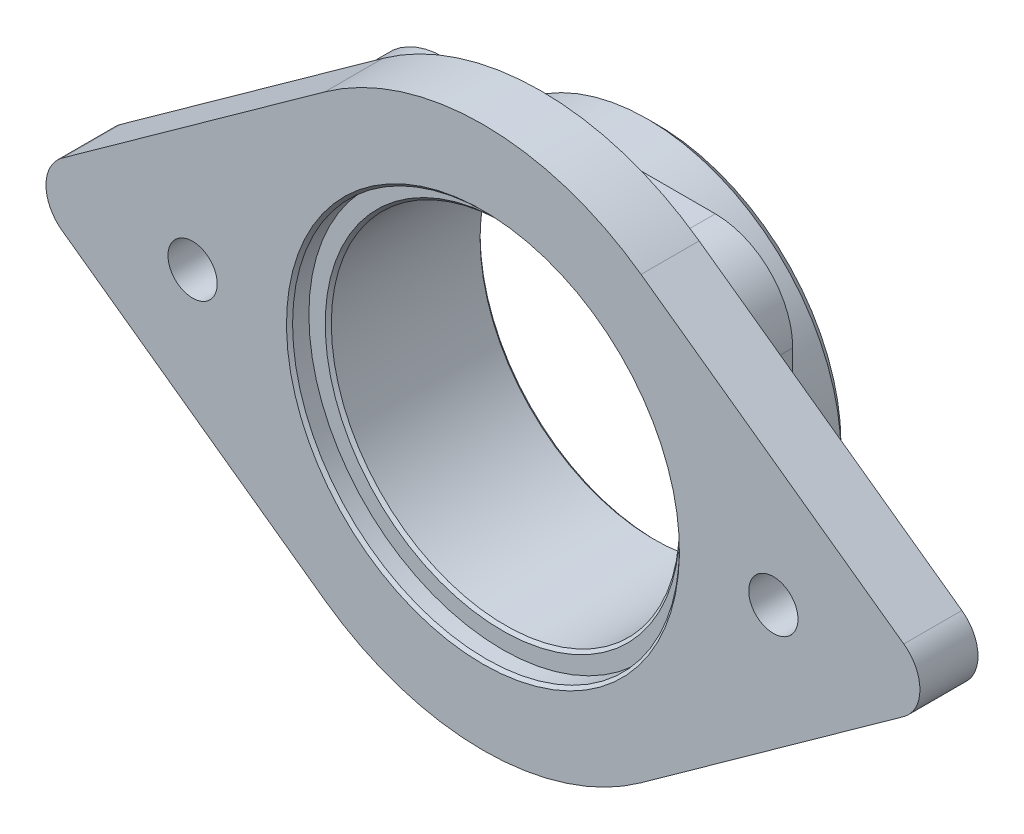
ISO-10303-21;
HEADER;
FILE_DESCRIPTION(('STEP AP214'),'2;1');
FILE_NAME('part.step','',(''),(''),'','','');
FILE_SCHEMA(('AUTOMOTIVE_DESIGN { 1 0 10303 214 1 1 1 1 }'));
ENDSEC;
DATA;
#1=APPLICATION_CONTEXT('core data for automotive mechanical design processes');
#2=APPLICATION_PROTOCOL_DEFINITION('international standard','automotive_design',2000,#1);
#3=PRODUCT_CONTEXT('',#1,'mechanical');
#4=PRODUCT('Part','Part','',(#3));
#5=PRODUCT_RELATED_PRODUCT_CATEGORY('part','',(#4));
#6=PRODUCT_DEFINITION_FORMATION('','',#4);
#7=PRODUCT_DEFINITION_CONTEXT('part definition',#1,'design');
#8=PRODUCT_DEFINITION('design','',#6,#7);
#9=PRODUCT_DEFINITION_SHAPE('','',#8);
#10=(LENGTH_UNIT() NAMED_UNIT(*) SI_UNIT(.MILLI.,.METRE.));
#11=(NAMED_UNIT(*) PLANE_ANGLE_UNIT() SI_UNIT($,.RADIAN.));
#12=(NAMED_UNIT(*) SI_UNIT($,.STERADIAN.) SOLID_ANGLE_UNIT());
#13=UNCERTAINTY_MEASURE_WITH_UNIT(LENGTH_MEASURE(1.E-05),#10,'distance_accuracy_value','');
#14=(GEOMETRIC_REPRESENTATION_CONTEXT(3) GLOBAL_UNCERTAINTY_ASSIGNED_CONTEXT((#13)) GLOBAL_UNIT_ASSIGNED_CONTEXT((#10,
#11,#12)) REPRESENTATION_CONTEXT('',''));
#15=CARTESIAN_POINT('',(0.,0.,0.));
#16=DIRECTION('',(0.,0.,1.));
#17=DIRECTION('',(1.,0.,0.));
#18=AXIS2_PLACEMENT_3D('',#15,#16,#17);
#19=CARTESIAN_POINT('',(0.,0.,-11.90625));
#20=DIRECTION('',(0.,0.,-1.));
#21=DIRECTION('',(-1.,0.,0.));
#22=AXIS2_PLACEMENT_3D('',#19,#20,#21);
#23=PLANE('',#22);
#24=CARTESIAN_POINT('',(0.,0.,-11.90625));
#25=DIRECTION('',(0.,0.,-1.));
#26=DIRECTION('',(-1.,0.,0.));
#27=AXIS2_PLACEMENT_3D('',#24,#25,#26);
#28=CIRCLE('',#27,14.5248);
#29=CARTESIAN_POINT('',(-14.5248,0.,-11.90625));
#30=VERTEX_POINT('',#29);
#31=EDGE_CURVE('E19',#30,#30,#28,.F.);
#32=ORIENTED_EDGE('',*,*,#31,.T.);
#33=EDGE_LOOP('',(#32));
#34=FACE_BOUND('',#33,.T.);
#35=CARTESIAN_POINT('',(0.,0.,-11.90625));
#36=DIRECTION('',(0.,0.,1.));
#37=DIRECTION('',(1.,0.,0.));
#38=AXIS2_PLACEMENT_3D('',#35,#36,#37);
#39=CIRCLE('',#38,15.06855);
#40=CARTESIAN_POINT('',(15.06855,0.,-11.90625));
#41=VERTEX_POINT('',#40);
#42=EDGE_CURVE('E167',#41,#41,#39,.T.);
#43=ORIENTED_EDGE('',*,*,#42,.F.);
#44=EDGE_LOOP('',(#43));
#45=FACE_BOUND('',#44,.T.);
#46=ADVANCED_FACE('F16',(#34,#45),#23,.T.);
#47=CARTESIAN_POINT('',(0.,0.,-11.90625));
#48=DIRECTION('',(0.,0.,-1.));
#49=DIRECTION('',(-1.,0.,0.));
#50=AXIS2_PLACEMENT_3D('',#47,#48,#49);
#51=CONICAL_SURFACE('',#50,14.5248,0.785398163397452);
#52=CARTESIAN_POINT('',(0.,0.,-11.65625));
#53=DIRECTION('',(0.,0.,-1.));
#54=DIRECTION('',(-1.,0.,0.));
#55=AXIS2_PLACEMENT_3D('',#52,#53,#54);
#56=CIRCLE('',#55,14.2748);
#57=CARTESIAN_POINT('',(-14.2748,0.,-11.65625));
#58=VERTEX_POINT('',#57);
#59=EDGE_CURVE('E165',#58,#58,#56,.F.);
#60=ORIENTED_EDGE('',*,*,#59,.T.);
#61=EDGE_LOOP('',(#60));
#62=FACE_BOUND('',#61,.T.);
#63=ORIENTED_EDGE('',*,*,#31,.F.);
#64=EDGE_LOOP('',(#63));
#65=FACE_BOUND('',#64,.T.);
#66=ADVANCED_FACE('F249',(#62,#65),#51,.F.);
#67=CARTESIAN_POINT('',(0.,0.,-11.1125));
#68=DIRECTION('',(0.,0.,1.));
#69=DIRECTION('',(1.,0.,0.));
#70=AXIS2_PLACEMENT_3D('',#67,#68,#69);
#71=CONICAL_SURFACE('',#70,15.8623,0.785398163397446);
#72=ORIENTED_EDGE('',*,*,#42,.T.);
#73=EDGE_LOOP('',(#72));
#74=FACE_BOUND('',#73,.T.);
#75=CARTESIAN_POINT('',(0.,0.,-11.1125));
#76=DIRECTION('',(0.,0.,1.));
#77=DIRECTION('',(1.,0.,0.));
#78=AXIS2_PLACEMENT_3D('',#75,#76,#77);
#79=CIRCLE('',#78,15.8623);
#80=CARTESIAN_POINT('',(15.8623,0.,-11.1125));
#81=VERTEX_POINT('',#80);
#82=EDGE_CURVE('E162',#81,#81,#79,.T.);
#83=ORIENTED_EDGE('',*,*,#82,.F.);
#84=EDGE_LOOP('',(#83));
#85=FACE_BOUND('',#84,.T.);
#86=ADVANCED_FACE('F251',(#74,#85),#71,.T.);
#87=CARTESIAN_POINT('',(0.,0.,2.38125));
#88=DIRECTION('',(0.,0.,-1.));
#89=DIRECTION('',(-1.,0.,0.));
#90=AXIS2_PLACEMENT_3D('',#87,#88,#89);
#91=CYLINDRICAL_SURFACE('',#90,14.2748);
#92=CARTESIAN_POINT('',(0.,0.,0.543749999999951));
#93=DIRECTION('',(0.,0.,1.));
#94=DIRECTION('',(1.,0.,0.));
#95=AXIS2_PLACEMENT_3D('',#92,#93,#94);
#96=CIRCLE('',#95,14.2748);
#97=CARTESIAN_POINT('',(14.2748,0.,0.54374999999995));
#98=VERTEX_POINT('',#97);
#99=EDGE_CURVE('E158',#98,#98,#96,.T.);
#100=ORIENTED_EDGE('',*,*,#99,.T.);
#101=EDGE_LOOP('',(#100));
#102=FACE_BOUND('',#101,.T.);
#103=ORIENTED_EDGE('',*,*,#59,.F.);
#104=EDGE_LOOP('',(#103));
#105=FACE_BOUND('',#104,.T.);
#106=ADVANCED_FACE('F258',(#102,#105),#91,.F.);
#107=CARTESIAN_POINT('',(0.,0.,-11.90625));
#108=DIRECTION('',(0.,0.,1.));
#109=DIRECTION('',(1.,0.,0.));
#110=AXIS2_PLACEMENT_3D('',#107,#108,#109);
#111=CYLINDRICAL_SURFACE('',#110,15.8623);
#112=ORIENTED_EDGE('',*,*,#82,.T.);
#113=EDGE_LOOP('',(#112));
#114=FACE_BOUND('',#113,.T.);
#115=CARTESIAN_POINT('',(0.,0.,-5.55625));
#116=DIRECTION('',(0.,0.,1.));
#117=DIRECTION('',(1.,0.,0.));
#118=AXIS2_PLACEMENT_3D('',#115,#116,#117);
#119=CIRCLE('',#118,15.8623);
#120=CARTESIAN_POINT('',(15.8623,0.,-5.55625));
#121=VERTEX_POINT('',#120);
#122=EDGE_CURVE('E161',#121,#121,#119,.F.);
#123=ORIENTED_EDGE('',*,*,#122,.T.);
#124=EDGE_LOOP('',(#123));
#125=FACE_BOUND('',#124,.T.);
#126=ADVANCED_FACE('F358',(#114,#125),#111,.T.);
#127=CARTESIAN_POINT('',(0.,0.,0.793750000000002));
#128=DIRECTION('',(0.,0.,1.));
#129=DIRECTION('',(1.,0.,0.));
#130=AXIS2_PLACEMENT_3D('',#127,#128,#129);
#131=CONICAL_SURFACE('',#130,14.5248,0.785398163397435);
#132=ORIENTED_EDGE('',*,*,#99,.F.);
#133=EDGE_LOOP('',(#132));
#134=FACE_BOUND('',#133,.T.);
#135=CARTESIAN_POINT('',(0.,0.,0.793750000000001));
#136=DIRECTION('',(0.,0.,1.));
#137=DIRECTION('',(1.,0.,0.));
#138=AXIS2_PLACEMENT_3D('',#135,#136,#137);
#139=CIRCLE('',#138,14.5248);
#140=CARTESIAN_POINT('',(14.5248,0.,0.793750000000001));
#141=VERTEX_POINT('',#140);
#142=EDGE_CURVE('E138',#141,#141,#139,.F.);
#143=ORIENTED_EDGE('',*,*,#142,.F.);
#144=EDGE_LOOP('',(#143));
#145=FACE_BOUND('',#144,.T.);
#146=ADVANCED_FACE('F354',(#134,#145),#131,.F.);
#147=CARTESIAN_POINT('',(0.,0.,-5.55625));
#148=DIRECTION('',(0.,0.,1.));
#149=DIRECTION('',(1.,0.,0.));
#150=AXIS2_PLACEMENT_3D('',#147,#148,#149);
#151=PLANE('',#150);
#152=ORIENTED_EDGE('',*,*,#122,.F.);
#153=EDGE_LOOP('',(#152));
#154=FACE_BOUND('',#153,.T.);
#155=CARTESIAN_POINT('',(11.1125,-11.1125,-5.55625));
#156=DIRECTION('',(0.,0.,1.));
#157=DIRECTION('',(1.,0.,0.));
#158=AXIS2_PLACEMENT_3D('',#155,#156,#157);
#159=CIRCLE('',#158,6.35);
#160=CARTESIAN_POINT('',(11.1125,-17.4625,-5.55625));
#161=VERTEX_POINT('',#160);
#162=CARTESIAN_POINT('',(17.4625,-11.1125,-5.55625));
#163=VERTEX_POINT('',#162);
#164=EDGE_CURVE('E151',#161,#163,#159,.T.);
#165=ORIENTED_EDGE('',*,*,#164,.F.);
#166=DIRECTION('',(1.,0.,0.));
#167=VECTOR('',#166,1.);
#168=CARTESIAN_POINT('',(17.4625,-17.4625,-5.55625));
#169=LINE('',#168,#167);
#170=CARTESIAN_POINT('',(-11.1125,-17.4625,-5.55625));
#171=VERTEX_POINT('',#170);
#172=EDGE_CURVE('E156',#161,#171,#169,.F.);
#173=ORIENTED_EDGE('',*,*,#172,.T.);
#174=CARTESIAN_POINT('',(-11.1125,-11.1125,-5.55625));
#175=DIRECTION('',(0.,0.,1.));
#176=DIRECTION('',(1.,0.,0.));
#177=AXIS2_PLACEMENT_3D('',#174,#175,#176);
#178=CIRCLE('',#177,6.35);
#179=CARTESIAN_POINT('',(-17.4625,-11.1125,-5.55625));
#180=VERTEX_POINT('',#179);
#181=EDGE_CURVE('E234',#180,#171,#178,.T.);
#182=ORIENTED_EDGE('',*,*,#181,.F.);
#183=DIRECTION('',(0.,1.,0.));
#184=VECTOR('',#183,1.);
#185=CARTESIAN_POINT('',(-17.4625,-17.4625,-5.55625));
#186=LINE('',#185,#184);
#187=CARTESIAN_POINT('',(-17.4625,11.1125,-5.55625));
#188=VERTEX_POINT('',#187);
#189=EDGE_CURVE('E233',#180,#188,#186,.T.);
#190=ORIENTED_EDGE('',*,*,#189,.T.);
#191=CARTESIAN_POINT('',(-11.1125,11.1125,-5.55625));
#192=DIRECTION('',(0.,0.,1.));
#193=DIRECTION('',(1.,0.,0.));
#194=AXIS2_PLACEMENT_3D('',#191,#192,#193);
#195=CIRCLE('',#194,6.35);
#196=CARTESIAN_POINT('',(-11.1125,17.4625,-5.55625));
#197=VERTEX_POINT('',#196);
#198=EDGE_CURVE('E229',#197,#188,#195,.T.);
#199=ORIENTED_EDGE('',*,*,#198,.F.);
#200=DIRECTION('',(1.,0.,0.));
#201=VECTOR('',#200,1.);
#202=CARTESIAN_POINT('',(17.4625,17.4625,-5.55625));
#203=LINE('',#202,#201);
#204=CARTESIAN_POINT('',(11.1125,17.4625,-5.55625));
#205=VERTEX_POINT('',#204);
#206=EDGE_CURVE('E134',#197,#205,#203,.T.);
#207=ORIENTED_EDGE('',*,*,#206,.T.);
#208=CARTESIAN_POINT('',(11.1125,11.1125,-5.55625));
#209=DIRECTION('',(0.,0.,1.));
#210=DIRECTION('',(1.,0.,0.));
#211=AXIS2_PLACEMENT_3D('',#208,#209,#210);
#212=CIRCLE('',#211,6.35);
#213=CARTESIAN_POINT('',(17.4625,11.1125,-5.55625));
#214=VERTEX_POINT('',#213);
#215=EDGE_CURVE('E127',#214,#205,#212,.T.);
#216=ORIENTED_EDGE('',*,*,#215,.F.);
#217=DIRECTION('',(0.,1.,0.));
#218=VECTOR('',#217,1.);
#219=CARTESIAN_POINT('',(17.4625,-17.4625,-5.55625));
#220=LINE('',#219,#218);
#221=EDGE_CURVE('E131',#214,#163,#220,.F.);
#222=ORIENTED_EDGE('',*,*,#221,.T.);
#223=EDGE_LOOP('',(#165,#173,#182,#190,#199,#207,#216,#222));
#224=FACE_BOUND('',#223,.T.);
#225=ADVANCED_FACE('F129',(#154,#224),#151,.F.);
#226=CARTESIAN_POINT('',(0.,0.,0.79375));
#227=DIRECTION('',(0.,0.,1.));
#228=DIRECTION('',(1.,0.,0.));
#229=AXIS2_PLACEMENT_3D('',#226,#227,#228);
#230=PLANE('',#229);
#231=CARTESIAN_POINT('',(0.,0.,0.79375));
#232=DIRECTION('',(0.,0.,1.));
#233=DIRECTION('',(1.,0.,0.));
#234=AXIS2_PLACEMENT_3D('',#231,#232,#233);
#235=CIRCLE('',#234,15.8623);
#236=CARTESIAN_POINT('',(15.8623,0.,0.79375));
#237=VERTEX_POINT('',#236);
#238=EDGE_CURVE('E226',#237,#237,#235,.T.);
#239=ORIENTED_EDGE('',*,*,#238,.T.);
#240=EDGE_LOOP('',(#239));
#241=FACE_BOUND('',#240,.T.);
#242=ORIENTED_EDGE('',*,*,#142,.T.);
#243=EDGE_LOOP('',(#242));
#244=FACE_BOUND('',#243,.T.);
#245=ADVANCED_FACE('F348',(#241,#244),#230,.T.);
#246=CARTESIAN_POINT('',(11.1125,11.1125,-5.55625));
#247=DIRECTION('',(0.,0.,1.));
#248=DIRECTION('',(1.,0.,0.));
#249=AXIS2_PLACEMENT_3D('',#246,#247,#248);
#250=CYLINDRICAL_SURFACE('',#249,6.35);
#251=CARTESIAN_POINT('',(11.1125,11.1125,-2.38125));
#252=DIRECTION('',(0.,0.,1.));
#253=DIRECTION('',(1.,0.,0.));
#254=AXIS2_PLACEMENT_3D('',#251,#252,#253);
#255=CIRCLE('',#254,6.35);
#256=CARTESIAN_POINT('',(11.1125,17.4625,-2.38125));
#257=VERTEX_POINT('',#256);
#258=CARTESIAN_POINT('',(17.4625,11.1125,-2.38125));
#259=VERTEX_POINT('',#258);
#260=EDGE_CURVE('E143',#257,#259,#255,.F.);
#261=ORIENTED_EDGE('',*,*,#260,.T.);
#262=DIRECTION('',(0.,0.,1.));
#263=VECTOR('',#262,1.);
#264=CARTESIAN_POINT('',(17.4625,11.1125,-5.55625));
#265=LINE('',#264,#263);
#266=EDGE_CURVE('E137',#259,#214,#265,.F.);
#267=ORIENTED_EDGE('',*,*,#266,.T.);
#268=ORIENTED_EDGE('',*,*,#215,.T.);
#269=DIRECTION('',(0.,0.,-1.));
#270=VECTOR('',#269,1.);
#271=CARTESIAN_POINT('',(11.1125,17.4625,-5.55625));
#272=LINE('',#271,#270);
#273=EDGE_CURVE('E607',#205,#257,#272,.F.);
#274=ORIENTED_EDGE('',*,*,#273,.T.);
#275=EDGE_LOOP('',(#261,#267,#268,#274));
#276=FACE_BOUND('',#275,.T.);
#277=ADVANCED_FACE('F141',(#276),#250,.T.);
#278=CARTESIAN_POINT('',(17.4625,-17.4625,-5.55625));
#279=DIRECTION('',(-1.,0.,0.));
#280=DIRECTION('',(0.,0.,1.));
#281=AXIS2_PLACEMENT_3D('',#278,#279,#280);
#282=PLANE('',#281);
#283=DIRECTION('',(0.,0.,1.));
#284=VECTOR('',#283,1.);
#285=CARTESIAN_POINT('',(17.4625,-11.1125,-5.55625));
#286=LINE('',#285,#284);
#287=CARTESIAN_POINT('',(17.4625,-11.1125,-2.38125));
#288=VERTEX_POINT('',#287);
#289=EDGE_CURVE('E149',#163,#288,#286,.T.);
#290=ORIENTED_EDGE('',*,*,#289,.F.);
#291=ORIENTED_EDGE('',*,*,#221,.F.);
#292=ORIENTED_EDGE('',*,*,#266,.F.);
#293=DIRECTION('',(0.,1.,0.));
#294=VECTOR('',#293,1.);
#295=CARTESIAN_POINT('',(17.4625,0.,-2.38125));
#296=LINE('',#295,#294);
#297=EDGE_CURVE('E224',#259,#288,#296,.F.);
#298=ORIENTED_EDGE('',*,*,#297,.T.);
#299=EDGE_LOOP('',(#290,#291,#292,#298));
#300=FACE_BOUND('',#299,.T.);
#301=ADVANCED_FACE('F147',(#300),#282,.F.);
#302=CARTESIAN_POINT('',(11.1125,-11.1125,-5.55625));
#303=DIRECTION('',(0.,0.,1.));
#304=DIRECTION('',(1.,0.,0.));
#305=AXIS2_PLACEMENT_3D('',#302,#303,#304);
#306=CYLINDRICAL_SURFACE('',#305,6.35);
#307=CARTESIAN_POINT('',(11.1125,-11.1125,-2.38125));
#308=DIRECTION('',(0.,0.,1.));
#309=DIRECTION('',(1.,0.,0.));
#310=AXIS2_PLACEMENT_3D('',#307,#308,#309);
#311=CIRCLE('',#310,6.35);
#312=CARTESIAN_POINT('',(11.1125,-17.4625,-2.38125));
#313=VERTEX_POINT('',#312);
#314=EDGE_CURVE('E222',#288,#313,#311,.F.);
#315=ORIENTED_EDGE('',*,*,#314,.T.);
#316=DIRECTION('',(0.,0.,1.));
#317=VECTOR('',#316,1.);
#318=CARTESIAN_POINT('',(11.1125,-17.4625,-5.55625));
#319=LINE('',#318,#317);
#320=EDGE_CURVE('E616',#313,#161,#319,.F.);
#321=ORIENTED_EDGE('',*,*,#320,.T.);
#322=ORIENTED_EDGE('',*,*,#164,.T.);
#323=ORIENTED_EDGE('',*,*,#289,.T.);
#324=EDGE_LOOP('',(#315,#321,#322,#323));
#325=FACE_BOUND('',#324,.T.);
#326=ADVANCED_FACE('F339',(#325),#306,.T.);
#327=CARTESIAN_POINT('',(17.4625,-17.4625,-5.55625));
#328=DIRECTION('',(0.,1.,0.));
#329=DIRECTION('',(0.,0.,1.));
#330=AXIS2_PLACEMENT_3D('',#327,#328,#329);
#331=PLANE('',#330);
#332=ORIENTED_EDGE('',*,*,#320,.F.);
#333=DIRECTION('',(1.,0.,0.));
#334=VECTOR('',#333,1.);
#335=CARTESIAN_POINT('',(0.,-17.4625,-2.38125));
#336=LINE('',#335,#334);
#337=CARTESIAN_POINT('',(-11.1125,-17.4625,-2.38125));
#338=VERTEX_POINT('',#337);
#339=EDGE_CURVE('E221',#313,#338,#336,.F.);
#340=ORIENTED_EDGE('',*,*,#339,.T.);
#341=DIRECTION('',(0.,0.,1.));
#342=VECTOR('',#341,1.);
#343=CARTESIAN_POINT('',(-11.1125,-17.4625,-5.55625));
#344=LINE('',#343,#342);
#345=EDGE_CURVE('E236',#171,#338,#344,.T.);
#346=ORIENTED_EDGE('',*,*,#345,.F.);
#347=ORIENTED_EDGE('',*,*,#172,.F.);
#348=EDGE_LOOP('',(#332,#340,#346,#347));
#349=FACE_BOUND('',#348,.T.);
#350=ADVANCED_FACE('F335',(#349),#331,.F.);
#351=CARTESIAN_POINT('',(-11.1125,-11.1125,-5.55625));
#352=DIRECTION('',(0.,0.,1.));
#353=DIRECTION('',(1.,0.,0.));
#354=AXIS2_PLACEMENT_3D('',#351,#352,#353);
#355=CYLINDRICAL_SURFACE('',#354,6.35);
#356=CARTESIAN_POINT('',(-11.1125,-11.1125,-2.38125));
#357=DIRECTION('',(0.,0.,1.));
#358=DIRECTION('',(1.,0.,0.));
#359=AXIS2_PLACEMENT_3D('',#356,#357,#358);
#360=CIRCLE('',#359,6.35);
#361=CARTESIAN_POINT('',(-17.4625,-11.1125,-2.38125));
#362=VERTEX_POINT('',#361);
#363=EDGE_CURVE('E219',#338,#362,#360,.F.);
#364=ORIENTED_EDGE('',*,*,#363,.T.);
#365=DIRECTION('',(0.,0.,-1.));
#366=VECTOR('',#365,1.);
#367=CARTESIAN_POINT('',(-17.4625,-11.1125,-5.55625));
#368=LINE('',#367,#366);
#369=EDGE_CURVE('E611',#362,#180,#368,.T.);
#370=ORIENTED_EDGE('',*,*,#369,.T.);
#371=ORIENTED_EDGE('',*,*,#181,.T.);
#372=ORIENTED_EDGE('',*,*,#345,.T.);
#373=EDGE_LOOP('',(#364,#370,#371,#372));
#374=FACE_BOUND('',#373,.T.);
#375=ADVANCED_FACE('F331',(#374),#355,.T.);
#376=CARTESIAN_POINT('',(-17.4625,-17.4625,-5.55625));
#377=DIRECTION('',(1.,0.,0.));
#378=DIRECTION('',(0.,0.,-1.));
#379=AXIS2_PLACEMENT_3D('',#376,#377,#378);
#380=PLANE('',#379);
#381=ORIENTED_EDGE('',*,*,#369,.F.);
#382=DIRECTION('',(0.,1.,0.));
#383=VECTOR('',#382,1.);
#384=CARTESIAN_POINT('',(-17.4625,0.,-2.38125));
#385=LINE('',#384,#383);
#386=CARTESIAN_POINT('',(-17.4625,11.1125,-2.38125));
#387=VERTEX_POINT('',#386);
#388=EDGE_CURVE('E218',#362,#387,#385,.T.);
#389=ORIENTED_EDGE('',*,*,#388,.T.);
#390=DIRECTION('',(0.,0.,1.));
#391=VECTOR('',#390,1.);
#392=CARTESIAN_POINT('',(-17.4625,11.1125,-5.55625));
#393=LINE('',#392,#391);
#394=EDGE_CURVE('E232',#188,#387,#393,.T.);
#395=ORIENTED_EDGE('',*,*,#394,.F.);
#396=ORIENTED_EDGE('',*,*,#189,.F.);
#397=EDGE_LOOP('',(#381,#389,#395,#396));
#398=FACE_BOUND('',#397,.T.);
#399=ADVANCED_FACE('F327',(#398),#380,.F.);
#400=CARTESIAN_POINT('',(-11.1125,11.1125,-5.55625));
#401=DIRECTION('',(0.,0.,1.));
#402=DIRECTION('',(1.,0.,0.));
#403=AXIS2_PLACEMENT_3D('',#400,#401,#402);
#404=CYLINDRICAL_SURFACE('',#403,6.35);
#405=CARTESIAN_POINT('',(-11.1125,11.1125,-2.38125));
#406=DIRECTION('',(0.,0.,1.));
#407=DIRECTION('',(1.,0.,0.));
#408=AXIS2_PLACEMENT_3D('',#405,#406,#407);
#409=CIRCLE('',#408,6.35);
#410=CARTESIAN_POINT('',(-11.1125,17.4625,-2.38125));
#411=VERTEX_POINT('',#410);
#412=EDGE_CURVE('E215',#387,#411,#409,.F.);
#413=ORIENTED_EDGE('',*,*,#412,.T.);
#414=DIRECTION('',(0.,0.,-1.));
#415=VECTOR('',#414,1.);
#416=CARTESIAN_POINT('',(-11.1125,17.4625,-5.55625));
#417=LINE('',#416,#415);
#418=EDGE_CURVE('E604',#411,#197,#417,.T.);
#419=ORIENTED_EDGE('',*,*,#418,.T.);
#420=ORIENTED_EDGE('',*,*,#198,.T.);
#421=ORIENTED_EDGE('',*,*,#394,.T.);
#422=EDGE_LOOP('',(#413,#419,#420,#421));
#423=FACE_BOUND('',#422,.T.);
#424=ADVANCED_FACE('F323',(#423),#404,.T.);
#425=CARTESIAN_POINT('',(17.4625,17.4625,-5.55625));
#426=DIRECTION('',(0.,-1.,0.));
#427=DIRECTION('',(0.,0.,-1.));
#428=AXIS2_PLACEMENT_3D('',#425,#426,#427);
#429=PLANE('',#428);
#430=ORIENTED_EDGE('',*,*,#418,.F.);
#431=DIRECTION('',(1.,0.,0.));
#432=VECTOR('',#431,1.);
#433=CARTESIAN_POINT('',(0.,17.4625,-2.38125));
#434=LINE('',#433,#432);
#435=EDGE_CURVE('E217',#411,#257,#434,.T.);
#436=ORIENTED_EDGE('',*,*,#435,.T.);
#437=ORIENTED_EDGE('',*,*,#273,.F.);
#438=ORIENTED_EDGE('',*,*,#206,.F.);
#439=EDGE_LOOP('',(#430,#436,#437,#438));
#440=FACE_BOUND('',#439,.T.);
#441=ADVANCED_FACE('F319',(#440),#429,.F.);
#442=CARTESIAN_POINT('',(0.,0.,0.79375));
#443=DIRECTION('',(0.,0.,1.));
#444=DIRECTION('',(1.,0.,0.));
#445=AXIS2_PLACEMENT_3D('',#442,#443,#444);
#446=CYLINDRICAL_SURFACE('',#445,15.8623);
#447=ORIENTED_EDGE('',*,*,#238,.F.);
#448=EDGE_LOOP('',(#447));
#449=FACE_BOUND('',#448,.T.);
#450=CARTESIAN_POINT('',(0.,0.,2.13125));
#451=DIRECTION('',(0.,0.,1.));
#452=DIRECTION('',(1.,0.,0.));
#453=AXIS2_PLACEMENT_3D('',#450,#451,#452);
#454=CIRCLE('',#453,15.8623);
#455=CARTESIAN_POINT('',(15.8623,0.,2.13125));
#456=VERTEX_POINT('',#455);
#457=EDGE_CURVE('E214',#456,#456,#454,.T.);
#458=ORIENTED_EDGE('',*,*,#457,.T.);
#459=EDGE_LOOP('',(#458));
#460=FACE_BOUND('',#459,.T.);
#461=ADVANCED_FACE('F315',(#449,#460),#446,.F.);
#462=CARTESIAN_POINT('',(0.,0.,-2.38125));
#463=DIRECTION('',(0.,0.,1.));
#464=DIRECTION('',(1.,0.,0.));
#465=AXIS2_PLACEMENT_3D('',#462,#463,#464);
#466=PLANE('',#465);
#467=CARTESIAN_POINT('',(23.8125,0.,-2.38125));
#468=DIRECTION('',(0.,0.,1.));
#469=DIRECTION('',(1.,0.,0.));
#470=AXIS2_PLACEMENT_3D('',#467,#468,#469);
#471=CIRCLE('',#470,2.01929999999999);
#472=CARTESIAN_POINT('',(25.8318,0.,-2.38125));
#473=VERTEX_POINT('',#472);
#474=EDGE_CURVE('E207',#473,#473,#471,.T.);
#475=ORIENTED_EDGE('',*,*,#474,.T.);
#476=EDGE_LOOP('',(#475));
#477=FACE_BOUND('',#476,.T.);
#478=CARTESIAN_POINT('',(-23.8125,0.,-2.38125));
#479=DIRECTION('',(0.,0.,1.));
#480=DIRECTION('',(1.,0.,0.));
#481=AXIS2_PLACEMENT_3D('',#478,#479,#480);
#482=CIRCLE('',#481,2.01929999999999);
#483=CARTESIAN_POINT('',(-21.7932,0.,-2.38125));
#484=VERTEX_POINT('',#483);
#485=EDGE_CURVE('E211',#484,#484,#482,.T.);
#486=ORIENTED_EDGE('',*,*,#485,.T.);
#487=EDGE_LOOP('',(#486));
#488=FACE_BOUND('',#487,.T.);
#489=ORIENTED_EDGE('',*,*,#412,.F.);
#490=ORIENTED_EDGE('',*,*,#388,.F.);
#491=ORIENTED_EDGE('',*,*,#363,.F.);
#492=ORIENTED_EDGE('',*,*,#339,.F.);
#493=ORIENTED_EDGE('',*,*,#314,.F.);
#494=ORIENTED_EDGE('',*,*,#297,.F.);
#495=ORIENTED_EDGE('',*,*,#260,.F.);
#496=ORIENTED_EDGE('',*,*,#435,.F.);
#497=EDGE_LOOP('',(#489,#490,#491,#492,#493,#494,#495,#496));
#498=FACE_BOUND('',#497,.T.);
#499=CARTESIAN_POINT('',(32.6571428571429,0.,-2.38125));
#500=DIRECTION('',(0.,0.,-1.));
#501=DIRECTION('',(-1.,0.,0.));
#502=AXIS2_PLACEMENT_3D('',#499,#500,#501);
#503=CIRCLE('',#502,3.175);
#504=CARTESIAN_POINT('',(34.5092261904762,-2.57883933706403,-2.38125));
#505=VERTEX_POINT('',#504);
#506=CARTESIAN_POINT('',(34.5092261904762,2.57883933706405,-2.38125));
#507=VERTEX_POINT('',#506);
#508=EDGE_CURVE('E203',#505,#507,#503,.F.);
#509=ORIENTED_EDGE('',*,*,#508,.F.);
#510=DIRECTION('',(0.812232862067414,0.583333333333333,0.));
#511=VECTOR('',#510,1.);
#512=CARTESIAN_POINT('',(12.9645833333333,-18.0518753594483,-2.38125));
#513=LINE('',#512,#511);
#514=CARTESIAN_POINT('',(12.9645833333333,-18.0518753594483,-2.38125));
#515=VERTEX_POINT('',#514);
#516=EDGE_CURVE('E210',#515,#505,#513,.T.);
#517=ORIENTED_EDGE('',*,*,#516,.F.);
#518=CARTESIAN_POINT('',(0.,0.,-2.38125));
#519=DIRECTION('',(0.,0.,-1.));
#520=DIRECTION('',(-1.,0.,0.));
#521=AXIS2_PLACEMENT_3D('',#518,#519,#520);
#522=CIRCLE('',#521,22.225);
#523=CARTESIAN_POINT('',(-12.9645833333333,-18.0518753594483,-2.38125));
#524=VERTEX_POINT('',#523);
#525=EDGE_CURVE('E189',#524,#515,#522,.F.);
#526=ORIENTED_EDGE('',*,*,#525,.F.);
#527=DIRECTION('',(-0.812232862067414,0.583333333333333,0.));
#528=VECTOR('',#527,1.);
#529=CARTESIAN_POINT('',(-12.9645833333333,-18.0518753594483,-2.38125));
#530=LINE('',#529,#528);
#531=CARTESIAN_POINT('',(-34.5092261904762,-2.57883933706404,-2.38125));
#532=VERTEX_POINT('',#531);
#533=EDGE_CURVE('E197',#524,#532,#530,.T.);
#534=ORIENTED_EDGE('',*,*,#533,.T.);
#535=CARTESIAN_POINT('',(-32.6571428571429,0.,-2.38125));
#536=DIRECTION('',(0.,0.,-1.));
#537=DIRECTION('',(-1.,0.,0.));
#538=AXIS2_PLACEMENT_3D('',#535,#536,#537);
#539=CIRCLE('',#538,3.175);
#540=CARTESIAN_POINT('',(-34.5092261904762,2.57883933706403,-2.38125));
#541=VERTEX_POINT('',#540);
#542=EDGE_CURVE('E194',#541,#532,#539,.F.);
#543=ORIENTED_EDGE('',*,*,#542,.F.);
#544=DIRECTION('',(0.812232862067414,0.583333333333333,0.));
#545=VECTOR('',#544,1.);
#546=CARTESIAN_POINT('',(-12.9645833333333,18.0518753594483,-2.38125));
#547=LINE('',#546,#545);
#548=CARTESIAN_POINT('',(-12.9645833333333,18.0518753594483,-2.38125));
#549=VERTEX_POINT('',#548);
#550=EDGE_CURVE('E634',#541,#549,#547,.T.);
#551=ORIENTED_EDGE('',*,*,#550,.T.);
#552=CARTESIAN_POINT('',(0.,0.,-2.38125));
#553=DIRECTION('',(0.,0.,-1.));
#554=DIRECTION('',(-1.,0.,0.));
#555=AXIS2_PLACEMENT_3D('',#552,#553,#554);
#556=CIRCLE('',#555,22.225);
#557=CARTESIAN_POINT('',(12.9645833333333,18.0518753594483,-2.38125));
#558=VERTEX_POINT('',#557);
#559=EDGE_CURVE('E199',#558,#549,#556,.F.);
#560=ORIENTED_EDGE('',*,*,#559,.F.);
#561=DIRECTION('',(-0.812232862067414,0.583333333333333,0.));
#562=VECTOR('',#561,1.);
#563=CARTESIAN_POINT('',(12.9645833333333,18.0518753594483,-2.38125));
#564=LINE('',#563,#562);
#565=EDGE_CURVE('E202',#507,#558,#564,.T.);
#566=ORIENTED_EDGE('',*,*,#565,.F.);
#567=EDGE_LOOP('',(#509,#517,#526,#534,#543,#551,#560,#566));
#568=FACE_BOUND('',#567,.T.);
#569=ADVANCED_FACE('F311',(#477,#488,#498,#568),#466,.F.);
#570=CARTESIAN_POINT('',(0.,0.,2.38125));
#571=DIRECTION('',(0.,0.,1.));
#572=DIRECTION('',(0.,-1.,0.));
#573=AXIS2_PLACEMENT_3D('',#570,#571,#572);
#574=CONICAL_SURFACE('',#573,16.1123,0.78539816339742);
#575=ORIENTED_EDGE('',*,*,#457,.F.);
#576=EDGE_LOOP('',(#575));
#577=FACE_BOUND('',#576,.T.);
#578=CARTESIAN_POINT('',(0.,0.,2.38125));
#579=DIRECTION('',(0.,0.,1.));
#580=DIRECTION('',(0.,-1.,0.));
#581=AXIS2_PLACEMENT_3D('',#578,#579,#580);
#582=CIRCLE('',#581,16.1123);
#583=CARTESIAN_POINT('',(0.,-16.1123,2.38125));
#584=VERTEX_POINT('',#583);
#585=EDGE_CURVE('E186',#584,#584,#582,.F.);
#586=ORIENTED_EDGE('',*,*,#585,.F.);
#587=EDGE_LOOP('',(#586));
#588=FACE_BOUND('',#587,.T.);
#589=ADVANCED_FACE('F307',(#577,#588),#574,.F.);
#590=CARTESIAN_POINT('',(-23.8125,0.,2.38125));
#591=DIRECTION('',(0.,0.,1.));
#592=DIRECTION('',(1.,0.,0.));
#593=AXIS2_PLACEMENT_3D('',#590,#591,#592);
#594=CYLINDRICAL_SURFACE('',#593,2.01929999999999);
#595=CARTESIAN_POINT('',(-23.8125,0.,2.38125));
#596=DIRECTION('',(0.,0.,1.));
#597=DIRECTION('',(1.,0.,0.));
#598=AXIS2_PLACEMENT_3D('',#595,#596,#597);
#599=CIRCLE('',#598,2.01929999999999);
#600=CARTESIAN_POINT('',(-21.7932,0.,2.38125));
#601=VERTEX_POINT('',#600);
#602=EDGE_CURVE('E183',#601,#601,#599,.F.);
#603=ORIENTED_EDGE('',*,*,#602,.F.);
#604=EDGE_LOOP('',(#603));
#605=FACE_BOUND('',#604,.T.);
#606=ORIENTED_EDGE('',*,*,#485,.F.);
#607=EDGE_LOOP('',(#606));
#608=FACE_BOUND('',#607,.T.);
#609=ADVANCED_FACE('F303',(#605,#608),#594,.F.);
#610=CARTESIAN_POINT('',(23.8125,0.,2.38125));
#611=DIRECTION('',(0.,0.,1.));
#612=DIRECTION('',(1.,0.,0.));
#613=AXIS2_PLACEMENT_3D('',#610,#611,#612);
#614=CYLINDRICAL_SURFACE('',#613,2.01929999999999);
#615=CARTESIAN_POINT('',(23.8125,0.,2.38125));
#616=DIRECTION('',(0.,0.,1.));
#617=DIRECTION('',(1.,0.,0.));
#618=AXIS2_PLACEMENT_3D('',#615,#616,#617);
#619=CIRCLE('',#618,2.01929999999999);
#620=CARTESIAN_POINT('',(25.8318,0.,2.38125));
#621=VERTEX_POINT('',#620);
#622=EDGE_CURVE('E180',#621,#621,#619,.F.);
#623=ORIENTED_EDGE('',*,*,#622,.F.);
#624=EDGE_LOOP('',(#623));
#625=FACE_BOUND('',#624,.T.);
#626=ORIENTED_EDGE('',*,*,#474,.F.);
#627=EDGE_LOOP('',(#626));
#628=FACE_BOUND('',#627,.T.);
#629=ADVANCED_FACE('F299',(#625,#628),#614,.F.);
#630=CARTESIAN_POINT('',(12.9645833333333,-18.0518753594483,2.38125));
#631=DIRECTION('',(0.583333333333333,-0.812232862067414,0.));
#632=DIRECTION('',(0.812232862067414,0.583333333333333,0.));
#633=AXIS2_PLACEMENT_3D('',#630,#631,#632);
#634=PLANE('',#633);
#635=DIRECTION('',(0.812232862067414,0.583333333333333,0.));
#636=VECTOR('',#635,1.);
#637=CARTESIAN_POINT('',(12.9645833333333,-18.0518753594483,2.38125));
#638=LINE('',#637,#636);
#639=CARTESIAN_POINT('',(12.9645833333333,-18.0518753594483,2.38125));
#640=VERTEX_POINT('',#639);
#641=CARTESIAN_POINT('',(34.5092261904762,-2.57883933706403,2.38125));
#642=VERTEX_POINT('',#641);
#643=EDGE_CURVE('E179',#640,#642,#638,.T.);
#644=ORIENTED_EDGE('',*,*,#643,.F.);
#645=DIRECTION('',(0.,0.,-1.));
#646=VECTOR('',#645,1.);
#647=CARTESIAN_POINT('',(12.9645833333333,-18.0518753594483,2.38125));
#648=LINE('',#647,#646);
#649=EDGE_CURVE('E192',#515,#640,#648,.F.);
#650=ORIENTED_EDGE('',*,*,#649,.F.);
#651=ORIENTED_EDGE('',*,*,#516,.T.);
#652=DIRECTION('',(0.,0.,-1.));
#653=VECTOR('',#652,1.);
#654=CARTESIAN_POINT('',(34.5092261904762,-2.57883933706403,2.38125));
#655=LINE('',#654,#653);
#656=EDGE_CURVE('E206',#642,#505,#655,.T.);
#657=ORIENTED_EDGE('',*,*,#656,.F.);
#658=EDGE_LOOP('',(#644,#650,#651,#657));
#659=FACE_BOUND('',#658,.T.);
#660=ADVANCED_FACE('F295',(#659),#634,.T.);
#661=CARTESIAN_POINT('',(32.6571428571429,0.,2.38125));
#662=DIRECTION('',(0.,0.,-1.));
#663=DIRECTION('',(-1.,0.,0.));
#664=AXIS2_PLACEMENT_3D('',#661,#662,#663);
#665=CYLINDRICAL_SURFACE('',#664,3.175);
#666=ORIENTED_EDGE('',*,*,#508,.T.);
#667=DIRECTION('',(0.,0.,1.));
#668=VECTOR('',#667,1.);
#669=CARTESIAN_POINT('',(34.5092261904762,2.57883933706405,2.38125));
#670=LINE('',#669,#668);
#671=CARTESIAN_POINT('',(34.5092261904762,2.57883933706405,2.38125));
#672=VERTEX_POINT('',#671);
#673=EDGE_CURVE('E205',#672,#507,#670,.F.);
#674=ORIENTED_EDGE('',*,*,#673,.F.);
#675=CARTESIAN_POINT('',(32.6571428571429,0.,2.38125));
#676=DIRECTION('',(0.,0.,-1.));
#677=DIRECTION('',(-1.,0.,0.));
#678=AXIS2_PLACEMENT_3D('',#675,#676,#677);
#679=CIRCLE('',#678,3.175);
#680=EDGE_CURVE('E176',#642,#672,#679,.F.);
#681=ORIENTED_EDGE('',*,*,#680,.F.);
#682=ORIENTED_EDGE('',*,*,#656,.T.);
#683=EDGE_LOOP('',(#666,#674,#681,#682));
#684=FACE_BOUND('',#683,.T.);
#685=ADVANCED_FACE('F291',(#684),#665,.T.);
#686=CARTESIAN_POINT('',(12.9645833333333,18.0518753594483,2.38125));
#687=DIRECTION('',(0.583333333333333,0.812232862067414,0.));
#688=DIRECTION('',(-0.812232862067414,0.583333333333333,0.));
#689=AXIS2_PLACEMENT_3D('',#686,#687,#688);
#690=PLANE('',#689);
#691=ORIENTED_EDGE('',*,*,#565,.T.);
#692=DIRECTION('',(0.,0.,-1.));
#693=VECTOR('',#692,1.);
#694=CARTESIAN_POINT('',(12.9645833333333,18.0518753594483,2.38125));
#695=LINE('',#694,#693);
#696=CARTESIAN_POINT('',(12.9645833333333,18.0518753594483,2.38125));
#697=VERTEX_POINT('',#696);
#698=EDGE_CURVE('E201',#697,#558,#695,.T.);
#699=ORIENTED_EDGE('',*,*,#698,.F.);
#700=DIRECTION('',(-0.812232862067414,0.583333333333333,0.));
#701=VECTOR('',#700,1.);
#702=CARTESIAN_POINT('',(34.5092261904762,2.57883933706405,2.38125));
#703=LINE('',#702,#701);
#704=EDGE_CURVE('E175',#672,#697,#703,.T.);
#705=ORIENTED_EDGE('',*,*,#704,.F.);
#706=ORIENTED_EDGE('',*,*,#673,.T.);
#707=EDGE_LOOP('',(#691,#699,#705,#706));
#708=FACE_BOUND('',#707,.T.);
#709=ADVANCED_FACE('F287',(#708),#690,.T.);
#710=CARTESIAN_POINT('',(0.,0.,2.38125));
#711=DIRECTION('',(0.,0.,-1.));
#712=DIRECTION('',(-1.,0.,0.));
#713=AXIS2_PLACEMENT_3D('',#710,#711,#712);
#714=CYLINDRICAL_SURFACE('',#713,22.225);
#715=CARTESIAN_POINT('',(0.,0.,2.38125));
#716=DIRECTION('',(0.,0.,-1.));
#717=DIRECTION('',(-1.,0.,0.));
#718=AXIS2_PLACEMENT_3D('',#715,#716,#717);
#719=CIRCLE('',#718,22.225);
#720=CARTESIAN_POINT('',(-12.9645833333333,18.0518753594483,2.38125));
#721=VERTEX_POINT('',#720);
#722=EDGE_CURVE('E172',#697,#721,#719,.F.);
#723=ORIENTED_EDGE('',*,*,#722,.F.);
#724=ORIENTED_EDGE('',*,*,#698,.T.);
#725=ORIENTED_EDGE('',*,*,#559,.T.);
#726=DIRECTION('',(0.,0.,1.));
#727=VECTOR('',#726,1.);
#728=CARTESIAN_POINT('',(-12.9645833333333,18.0518753594483,2.38125));
#729=LINE('',#728,#727);
#730=EDGE_CURVE('E636',#549,#721,#729,.T.);
#731=ORIENTED_EDGE('',*,*,#730,.T.);
#732=EDGE_LOOP('',(#723,#724,#725,#731));
#733=FACE_BOUND('',#732,.T.);
#734=ADVANCED_FACE('F283',(#733),#714,.T.);
#735=CARTESIAN_POINT('',(-12.9645833333333,18.0518753594483,2.38125));
#736=DIRECTION('',(0.583333333333333,-0.812232862067414,0.));
#737=DIRECTION('',(0.812232862067414,0.583333333333333,0.));
#738=AXIS2_PLACEMENT_3D('',#735,#736,#737);
#739=PLANE('',#738);
#740=DIRECTION('',(0.,0.,-1.));
#741=VECTOR('',#740,1.);
#742=CARTESIAN_POINT('',(-34.5092261904762,2.57883933706403,2.38125));
#743=LINE('',#742,#741);
#744=CARTESIAN_POINT('',(-34.5092261904762,2.57883933706403,2.38125));
#745=VERTEX_POINT('',#744);
#746=EDGE_CURVE('E198',#745,#541,#743,.T.);
#747=ORIENTED_EDGE('',*,*,#746,.F.);
#748=DIRECTION('',(-0.812232862067414,-0.583333333333333,0.));
#749=VECTOR('',#748,1.);
#750=CARTESIAN_POINT('',(-12.9645833333333,18.0518753594483,2.38125));
#751=LINE('',#750,#749);
#752=EDGE_CURVE('E171',#721,#745,#751,.T.);
#753=ORIENTED_EDGE('',*,*,#752,.F.);
#754=ORIENTED_EDGE('',*,*,#730,.F.);
#755=ORIENTED_EDGE('',*,*,#550,.F.);
#756=EDGE_LOOP('',(#747,#753,#754,#755));
#757=FACE_BOUND('',#756,.T.);
#758=ADVANCED_FACE('F279',(#757),#739,.F.);
#759=CARTESIAN_POINT('',(-32.6571428571429,0.,2.38125));
#760=DIRECTION('',(0.,0.,-1.));
#761=DIRECTION('',(-1.,0.,0.));
#762=AXIS2_PLACEMENT_3D('',#759,#760,#761);
#763=CYLINDRICAL_SURFACE('',#762,3.175);
#764=ORIENTED_EDGE('',*,*,#542,.T.);
#765=DIRECTION('',(0.,0.,1.));
#766=VECTOR('',#765,1.);
#767=CARTESIAN_POINT('',(-34.5092261904762,-2.57883933706404,2.38125));
#768=LINE('',#767,#766);
#769=CARTESIAN_POINT('',(-34.5092261904762,-2.57883933706404,2.38125));
#770=VERTEX_POINT('',#769);
#771=EDGE_CURVE('E193',#532,#770,#768,.T.);
#772=ORIENTED_EDGE('',*,*,#771,.T.);
#773=CARTESIAN_POINT('',(-32.6571428571429,0.,2.38125));
#774=DIRECTION('',(0.,0.,-1.));
#775=DIRECTION('',(-1.,0.,0.));
#776=AXIS2_PLACEMENT_3D('',#773,#774,#775);
#777=CIRCLE('',#776,3.175);
#778=EDGE_CURVE('E169',#745,#770,#777,.F.);
#779=ORIENTED_EDGE('',*,*,#778,.F.);
#780=ORIENTED_EDGE('',*,*,#746,.T.);
#781=EDGE_LOOP('',(#764,#772,#779,#780));
#782=FACE_BOUND('',#781,.T.);
#783=ADVANCED_FACE('F276',(#782),#763,.T.);
#784=CARTESIAN_POINT('',(-12.9645833333333,-18.0518753594483,2.38125));
#785=DIRECTION('',(0.583333333333333,0.812232862067414,0.));
#786=DIRECTION('',(-0.812232862067414,0.583333333333333,0.));
#787=AXIS2_PLACEMENT_3D('',#784,#785,#786);
#788=PLANE('',#787);
#789=ORIENTED_EDGE('',*,*,#771,.F.);
#790=ORIENTED_EDGE('',*,*,#533,.F.);
#791=DIRECTION('',(0.,0.,-1.));
#792=VECTOR('',#791,1.);
#793=CARTESIAN_POINT('',(-12.9645833333333,-18.0518753594483,2.38125));
#794=LINE('',#793,#792);
#795=CARTESIAN_POINT('',(-12.9645833333333,-18.0518753594483,2.38125));
#796=VERTEX_POINT('',#795);
#797=EDGE_CURVE('E34',#796,#524,#794,.T.);
#798=ORIENTED_EDGE('',*,*,#797,.F.);
#799=DIRECTION('',(0.812232862067414,-0.583333333333333,0.));
#800=VECTOR('',#799,1.);
#801=CARTESIAN_POINT('',(-34.5092261904762,-2.57883933706404,2.38125));
#802=LINE('',#801,#800);
#803=EDGE_CURVE('E25',#770,#796,#802,.T.);
#804=ORIENTED_EDGE('',*,*,#803,.F.);
#805=EDGE_LOOP('',(#789,#790,#798,#804));
#806=FACE_BOUND('',#805,.T.);
#807=ADVANCED_FACE('F268',(#806),#788,.F.);
#808=CARTESIAN_POINT('',(0.,0.,2.38125));
#809=DIRECTION('',(0.,0.,-1.));
#810=DIRECTION('',(-1.,0.,0.));
#811=AXIS2_PLACEMENT_3D('',#808,#809,#810);
#812=CYLINDRICAL_SURFACE('',#811,22.225);
#813=CARTESIAN_POINT('',(0.,0.,2.38125));
#814=DIRECTION('',(0.,0.,-1.));
#815=DIRECTION('',(-1.,0.,0.));
#816=AXIS2_PLACEMENT_3D('',#813,#814,#815);
#817=CIRCLE('',#816,22.225);
#818=EDGE_CURVE('E11',#796,#640,#817,.F.);
#819=ORIENTED_EDGE('',*,*,#818,.F.);
#820=ORIENTED_EDGE('',*,*,#797,.T.);
#821=ORIENTED_EDGE('',*,*,#525,.T.);
#822=ORIENTED_EDGE('',*,*,#649,.T.);
#823=EDGE_LOOP('',(#819,#820,#821,#822));
#824=FACE_BOUND('',#823,.T.);
#825=ADVANCED_FACE('F262',(#824),#812,.T.);
#826=CARTESIAN_POINT('',(0.,0.,2.38125));
#827=DIRECTION('',(0.,0.,1.));
#828=DIRECTION('',(1.,0.,0.));
#829=AXIS2_PLACEMENT_3D('',#826,#827,#828);
#830=PLANE('',#829);
#831=ORIENTED_EDGE('',*,*,#803,.T.);
#832=ORIENTED_EDGE('',*,*,#818,.T.);
#833=ORIENTED_EDGE('',*,*,#643,.T.);
#834=ORIENTED_EDGE('',*,*,#680,.T.);
#835=ORIENTED_EDGE('',*,*,#704,.T.);
#836=ORIENTED_EDGE('',*,*,#722,.T.);
#837=ORIENTED_EDGE('',*,*,#752,.T.);
#838=ORIENTED_EDGE('',*,*,#778,.T.);
#839=EDGE_LOOP('',(#831,#832,#833,#834,#835,#836,#837,#838));
#840=FACE_BOUND('',#839,.T.);
#841=ORIENTED_EDGE('',*,*,#622,.T.);
#842=EDGE_LOOP('',(#841));
#843=FACE_BOUND('',#842,.T.);
#844=ORIENTED_EDGE('',*,*,#602,.T.);
#845=EDGE_LOOP('',(#844));
#846=FACE_BOUND('',#845,.T.);
#847=ORIENTED_EDGE('',*,*,#585,.T.);
#848=EDGE_LOOP('',(#847));
#849=FACE_BOUND('',#848,.T.);
#850=ADVANCED_FACE('F260',(#840,#843,#846,#849),#830,.T.);
#851=CLOSED_SHELL('',(#46,#66,#86,#106,#126,#146,#225,#245,#277,#301,#326,#350,#375,#399,#424,
#441,#461,#569,#589,#609,#629,#660,#685,#709,#734,#758,#783,#807,#825,#850));
#852=MANIFOLD_SOLID_BREP('B1',#851);
#853=ADVANCED_BREP_SHAPE_REPRESENTATION('',(#18,#852),#14);
#854=SHAPE_DEFINITION_REPRESENTATION(#9,#853);
ENDSEC;
END-ISO-10303-21;
